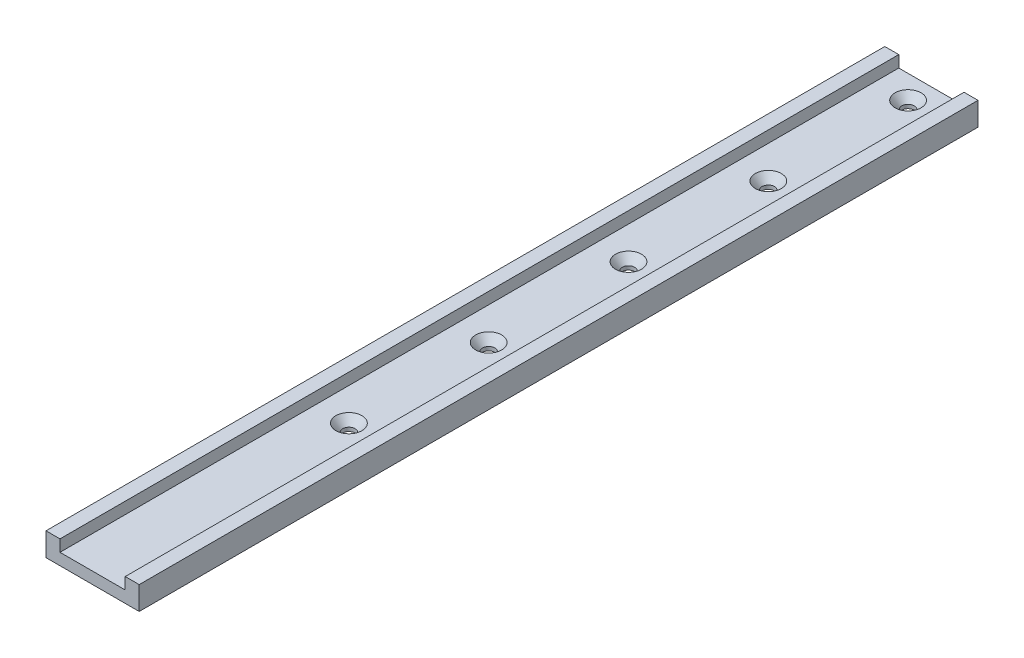
ISO-10303-21;
HEADER;
FILE_DESCRIPTION(('STEP AP214'),'2;1');
FILE_NAME('part.step','',(''),(''),'','','');
FILE_SCHEMA(('AUTOMOTIVE_DESIGN { 1 0 10303 214 1 1 1 1 }'));
ENDSEC;
DATA;
#1=APPLICATION_CONTEXT('core data for automotive mechanical design processes');
#2=APPLICATION_PROTOCOL_DEFINITION('international standard','automotive_design',2000,#1);
#3=PRODUCT_CONTEXT('',#1,'mechanical');
#4=PRODUCT('Part','Part','',(#3));
#5=PRODUCT_RELATED_PRODUCT_CATEGORY('part','',(#4));
#6=PRODUCT_DEFINITION_FORMATION('','',#4);
#7=PRODUCT_DEFINITION_CONTEXT('part definition',#1,'design');
#8=PRODUCT_DEFINITION('design','',#6,#7);
#9=PRODUCT_DEFINITION_SHAPE('','',#8);
#10=(LENGTH_UNIT() NAMED_UNIT(*) SI_UNIT(.MILLI.,.METRE.));
#11=(NAMED_UNIT(*) PLANE_ANGLE_UNIT() SI_UNIT($,.RADIAN.));
#12=(NAMED_UNIT(*) SI_UNIT($,.STERADIAN.) SOLID_ANGLE_UNIT());
#13=UNCERTAINTY_MEASURE_WITH_UNIT(LENGTH_MEASURE(1.E-05),#10,'distance_accuracy_value','');
#14=(GEOMETRIC_REPRESENTATION_CONTEXT(3) GLOBAL_UNCERTAINTY_ASSIGNED_CONTEXT((#13)) GLOBAL_UNIT_ASSIGNED_CONTEXT((#10,
#11,#12)) REPRESENTATION_CONTEXT('',''));
#15=CARTESIAN_POINT('',(0.,0.,0.));
#16=DIRECTION('',(0.,0.,1.));
#17=DIRECTION('',(1.,0.,0.));
#18=AXIS2_PLACEMENT_3D('',#15,#16,#17);
#19=CARTESIAN_POINT('',(-25.4,12.7,457.2));
#20=DIRECTION('',(1.,0.,0.));
#21=DIRECTION('',(0.,1.,0.));
#22=AXIS2_PLACEMENT_3D('',#19,#20,#21);
#23=PLANE('',#22);
#24=DIRECTION('',(0.,-1.,0.));
#25=VECTOR('',#24,1.);
#26=CARTESIAN_POINT('',(-25.4,12.7,0.));
#27=LINE('',#26,#25);
#28=CARTESIAN_POINT('',(-25.4,12.7,0.));
#29=VERTEX_POINT('',#28);
#30=CARTESIAN_POINT('',(-25.4,0.,0.));
#31=VERTEX_POINT('',#30);
#32=EDGE_CURVE('E133',#29,#31,#27,.T.);
#33=ORIENTED_EDGE('',*,*,#32,.T.);
#34=DIRECTION('',(0.,0.,-1.));
#35=VECTOR('',#34,1.);
#36=CARTESIAN_POINT('',(-25.4,0.,457.2));
#37=LINE('',#36,#35);
#38=CARTESIAN_POINT('',(-25.4,0.,457.2));
#39=VERTEX_POINT('',#38);
#40=EDGE_CURVE('E11',#39,#31,#37,.T.);
#41=ORIENTED_EDGE('',*,*,#40,.F.);
#42=DIRECTION('',(0.,-1.,0.));
#43=VECTOR('',#42,1.);
#44=CARTESIAN_POINT('',(-25.4,12.7,457.2));
#45=LINE('',#44,#43);
#46=CARTESIAN_POINT('',(-25.4,12.7,457.2));
#47=VERTEX_POINT('',#46);
#48=EDGE_CURVE('E148',#47,#39,#45,.T.);
#49=ORIENTED_EDGE('',*,*,#48,.F.);
#50=DIRECTION('',(0.,0.,-1.));
#51=VECTOR('',#50,1.);
#52=CARTESIAN_POINT('',(-25.4,12.7,457.2));
#53=LINE('',#52,#51);
#54=EDGE_CURVE('E129',#47,#29,#53,.T.);
#55=ORIENTED_EDGE('',*,*,#54,.T.);
#56=EDGE_LOOP('',(#33,#41,#49,#55));
#57=FACE_BOUND('',#56,.T.);
#58=ADVANCED_FACE('F37',(#57),#23,.F.);
#59=CARTESIAN_POINT('',(-25.4,0.,457.2));
#60=DIRECTION('',(0.,1.,0.));
#61=DIRECTION('',(-1.,0.,0.));
#62=AXIS2_PLACEMENT_3D('',#59,#60,#61);
#63=PLANE('',#62);
#64=CARTESIAN_POINT('',(0.,0.,12.7));
#65=DIRECTION('',(0.,1.,0.));
#66=DIRECTION('',(0.,0.,1.));
#67=AXIS2_PLACEMENT_3D('',#64,#65,#66);
#68=CIRCLE('',#67,3.3782);
#69=CARTESIAN_POINT('',(0.,0.,16.0782));
#70=VERTEX_POINT('',#69);
#71=EDGE_CURVE('E216',#70,#70,#68,.T.);
#72=ORIENTED_EDGE('',*,*,#71,.T.);
#73=EDGE_LOOP('',(#72));
#74=FACE_BOUND('',#73,.T.);
#75=CARTESIAN_POINT('',(0.,0.,88.9));
#76=DIRECTION('',(0.,1.,0.));
#77=DIRECTION('',(0.,0.,1.));
#78=AXIS2_PLACEMENT_3D('',#75,#76,#77);
#79=CIRCLE('',#78,3.3782);
#80=CARTESIAN_POINT('',(0.,0.,92.2782));
#81=VERTEX_POINT('',#80);
#82=EDGE_CURVE('E207',#81,#81,#79,.T.);
#83=ORIENTED_EDGE('',*,*,#82,.T.);
#84=EDGE_LOOP('',(#83));
#85=FACE_BOUND('',#84,.T.);
#86=CARTESIAN_POINT('',(0.,0.,165.1));
#87=DIRECTION('',(0.,1.,0.));
#88=DIRECTION('',(0.,0.,1.));
#89=AXIS2_PLACEMENT_3D('',#86,#87,#88);
#90=CIRCLE('',#89,3.3782);
#91=CARTESIAN_POINT('',(0.,0.,168.4782));
#92=VERTEX_POINT('',#91);
#93=EDGE_CURVE('E198',#92,#92,#90,.T.);
#94=ORIENTED_EDGE('',*,*,#93,.T.);
#95=EDGE_LOOP('',(#94));
#96=FACE_BOUND('',#95,.T.);
#97=CARTESIAN_POINT('',(0.,0.,241.3));
#98=DIRECTION('',(0.,1.,0.));
#99=DIRECTION('',(0.,0.,1.));
#100=AXIS2_PLACEMENT_3D('',#97,#98,#99);
#101=CIRCLE('',#100,3.3782);
#102=CARTESIAN_POINT('',(0.,0.,244.6782));
#103=VERTEX_POINT('',#102);
#104=EDGE_CURVE('E189',#103,#103,#101,.T.);
#105=ORIENTED_EDGE('',*,*,#104,.T.);
#106=EDGE_LOOP('',(#105));
#107=FACE_BOUND('',#106,.T.);
#108=CARTESIAN_POINT('',(0.,0.,317.5));
#109=DIRECTION('',(0.,1.,0.));
#110=DIRECTION('',(0.,0.,1.));
#111=AXIS2_PLACEMENT_3D('',#108,#109,#110);
#112=CIRCLE('',#111,3.3782);
#113=CARTESIAN_POINT('',(0.,0.,320.8782));
#114=VERTEX_POINT('',#113);
#115=EDGE_CURVE('E137',#114,#114,#112,.T.);
#116=ORIENTED_EDGE('',*,*,#115,.T.);
#117=EDGE_LOOP('',(#116));
#118=FACE_BOUND('',#117,.T.);
#119=DIRECTION('',(1.,0.,0.));
#120=VECTOR('',#119,1.);
#121=CARTESIAN_POINT('',(-25.4,0.,0.));
#122=LINE('',#121,#120);
#123=CARTESIAN_POINT('',(25.4,0.,0.));
#124=VERTEX_POINT('',#123);
#125=EDGE_CURVE('E136',#31,#124,#122,.T.);
#126=ORIENTED_EDGE('',*,*,#125,.T.);
#127=DIRECTION('',(0.,0.,-1.));
#128=VECTOR('',#127,1.);
#129=CARTESIAN_POINT('',(25.4,0.,457.2));
#130=LINE('',#129,#128);
#131=CARTESIAN_POINT('',(25.4,0.,457.2));
#132=VERTEX_POINT('',#131);
#133=EDGE_CURVE('E45',#132,#124,#130,.T.);
#134=ORIENTED_EDGE('',*,*,#133,.F.);
#135=DIRECTION('',(1.,0.,0.));
#136=VECTOR('',#135,1.);
#137=CARTESIAN_POINT('',(-25.4,0.,457.2));
#138=LINE('',#137,#136);
#139=EDGE_CURVE('E96',#39,#132,#138,.T.);
#140=ORIENTED_EDGE('',*,*,#139,.F.);
#141=ORIENTED_EDGE('',*,*,#40,.T.);
#142=EDGE_LOOP('',(#126,#134,#140,#141));
#143=FACE_BOUND('',#142,.T.);
#144=ADVANCED_FACE('F256',(#74,#85,#96,#107,#118,#143),#63,.F.);
#145=CARTESIAN_POINT('',(25.4,12.7,457.2));
#146=DIRECTION('',(-1.,0.,0.));
#147=DIRECTION('',(0.,0.,1.));
#148=AXIS2_PLACEMENT_3D('',#145,#146,#147);
#149=PLANE('',#148);
#150=DIRECTION('',(0.,1.,0.));
#151=VECTOR('',#150,1.);
#152=CARTESIAN_POINT('',(25.4,12.7,0.));
#153=LINE('',#152,#151);
#154=CARTESIAN_POINT('',(25.4,12.7,0.));
#155=VERTEX_POINT('',#154);
#156=EDGE_CURVE('E139',#124,#155,#153,.T.);
#157=ORIENTED_EDGE('',*,*,#156,.T.);
#158=DIRECTION('',(0.,0.,-1.));
#159=VECTOR('',#158,1.);
#160=CARTESIAN_POINT('',(25.4,12.7,457.2));
#161=LINE('',#160,#159);
#162=CARTESIAN_POINT('',(25.4,12.7,457.2));
#163=VERTEX_POINT('',#162);
#164=EDGE_CURVE('E155',#163,#155,#161,.T.);
#165=ORIENTED_EDGE('',*,*,#164,.F.);
#166=DIRECTION('',(0.,1.,0.));
#167=VECTOR('',#166,1.);
#168=CARTESIAN_POINT('',(25.4,12.7,457.2));
#169=LINE('',#168,#167);
#170=EDGE_CURVE('E163',#132,#163,#169,.T.);
#171=ORIENTED_EDGE('',*,*,#170,.F.);
#172=ORIENTED_EDGE('',*,*,#133,.T.);
#173=EDGE_LOOP('',(#157,#165,#171,#172));
#174=FACE_BOUND('',#173,.T.);
#175=ADVANCED_FACE('F161',(#174),#149,.F.);
#176=CARTESIAN_POINT('',(17.78,12.7,457.2));
#177=DIRECTION('',(0.,-1.,0.));
#178=DIRECTION('',(1.,0.,0.));
#179=AXIS2_PLACEMENT_3D('',#176,#177,#178);
#180=PLANE('',#179);
#181=DIRECTION('',(-1.,0.,0.));
#182=VECTOR('',#181,1.);
#183=CARTESIAN_POINT('',(17.78,12.7,0.));
#184=LINE('',#183,#182);
#185=CARTESIAN_POINT('',(17.78,12.7,0.));
#186=VERTEX_POINT('',#185);
#187=EDGE_CURVE('E141',#155,#186,#184,.T.);
#188=ORIENTED_EDGE('',*,*,#187,.T.);
#189=DIRECTION('',(0.,0.,-1.));
#190=VECTOR('',#189,1.);
#191=CARTESIAN_POINT('',(17.78,12.7,457.2));
#192=LINE('',#191,#190);
#193=CARTESIAN_POINT('',(17.78,12.7,457.2));
#194=VERTEX_POINT('',#193);
#195=EDGE_CURVE('E152',#194,#186,#192,.T.);
#196=ORIENTED_EDGE('',*,*,#195,.F.);
#197=DIRECTION('',(-1.,0.,0.));
#198=VECTOR('',#197,1.);
#199=CARTESIAN_POINT('',(17.78,12.7,457.2));
#200=LINE('',#199,#198);
#201=EDGE_CURVE('E175',#163,#194,#200,.T.);
#202=ORIENTED_EDGE('',*,*,#201,.F.);
#203=ORIENTED_EDGE('',*,*,#164,.T.);
#204=EDGE_LOOP('',(#188,#196,#202,#203));
#205=FACE_BOUND('',#204,.T.);
#206=ADVANCED_FACE('F171',(#205),#180,.F.);
#207=CARTESIAN_POINT('',(17.78,12.7,457.2));
#208=DIRECTION('',(1.,0.,0.));
#209=DIRECTION('',(0.,0.,-1.));
#210=AXIS2_PLACEMENT_3D('',#207,#208,#209);
#211=PLANE('',#210);
#212=DIRECTION('',(0.,-1.,0.));
#213=VECTOR('',#212,1.);
#214=CARTESIAN_POINT('',(17.78,12.7,0.));
#215=LINE('',#214,#213);
#216=CARTESIAN_POINT('',(17.78,6.35,0.));
#217=VERTEX_POINT('',#216);
#218=EDGE_CURVE('E143',#186,#217,#215,.T.);
#219=ORIENTED_EDGE('',*,*,#218,.T.);
#220=DIRECTION('',(0.,0.,-1.));
#221=VECTOR('',#220,1.);
#222=CARTESIAN_POINT('',(17.78,6.35,457.2));
#223=LINE('',#222,#221);
#224=CARTESIAN_POINT('',(17.78,6.35,457.2));
#225=VERTEX_POINT('',#224);
#226=EDGE_CURVE('E124',#225,#217,#223,.T.);
#227=ORIENTED_EDGE('',*,*,#226,.F.);
#228=DIRECTION('',(0.,-1.,0.));
#229=VECTOR('',#228,1.);
#230=CARTESIAN_POINT('',(17.78,12.7,457.2));
#231=LINE('',#230,#229);
#232=EDGE_CURVE('E115',#194,#225,#231,.T.);
#233=ORIENTED_EDGE('',*,*,#232,.F.);
#234=ORIENTED_EDGE('',*,*,#195,.T.);
#235=EDGE_LOOP('',(#219,#227,#233,#234));
#236=FACE_BOUND('',#235,.T.);
#237=ADVANCED_FACE('F174',(#236),#211,.F.);
#238=CARTESIAN_POINT('',(-17.78,6.35,457.2));
#239=DIRECTION('',(0.,-1.,0.));
#240=DIRECTION('',(0.,0.,-1.));
#241=AXIS2_PLACEMENT_3D('',#238,#239,#240);
#242=PLANE('',#241);
#243=CARTESIAN_POINT('',(0.,6.35,12.7));
#244=DIRECTION('',(0.,1.,0.));
#245=DIRECTION('',(0.,0.,1.));
#246=AXIS2_PLACEMENT_3D('',#243,#244,#245);
#247=CIRCLE('',#246,7.1012812);
#248=CARTESIAN_POINT('',(0.,6.35,19.8012812));
#249=VERTEX_POINT('',#248);
#250=EDGE_CURVE('E222',#249,#249,#247,.T.);
#251=ORIENTED_EDGE('',*,*,#250,.F.);
#252=EDGE_LOOP('',(#251));
#253=FACE_BOUND('',#252,.T.);
#254=CARTESIAN_POINT('',(0.,6.35,88.9));
#255=DIRECTION('',(0.,1.,0.));
#256=DIRECTION('',(0.,0.,1.));
#257=AXIS2_PLACEMENT_3D('',#254,#255,#256);
#258=CIRCLE('',#257,7.1012812);
#259=CARTESIAN_POINT('',(0.,6.35,96.0012812));
#260=VERTEX_POINT('',#259);
#261=EDGE_CURVE('E213',#260,#260,#258,.T.);
#262=ORIENTED_EDGE('',*,*,#261,.F.);
#263=EDGE_LOOP('',(#262));
#264=FACE_BOUND('',#263,.T.);
#265=CARTESIAN_POINT('',(0.,6.35,165.1));
#266=DIRECTION('',(0.,1.,0.));
#267=DIRECTION('',(0.,0.,1.));
#268=AXIS2_PLACEMENT_3D('',#265,#266,#267);
#269=CIRCLE('',#268,7.1012812);
#270=CARTESIAN_POINT('',(0.,6.35,172.2012812));
#271=VERTEX_POINT('',#270);
#272=EDGE_CURVE('E204',#271,#271,#269,.T.);
#273=ORIENTED_EDGE('',*,*,#272,.F.);
#274=EDGE_LOOP('',(#273));
#275=FACE_BOUND('',#274,.T.);
#276=CARTESIAN_POINT('',(0.,6.35,241.3));
#277=DIRECTION('',(0.,1.,0.));
#278=DIRECTION('',(0.,0.,1.));
#279=AXIS2_PLACEMENT_3D('',#276,#277,#278);
#280=CIRCLE('',#279,7.1012812);
#281=CARTESIAN_POINT('',(0.,6.35,248.4012812));
#282=VERTEX_POINT('',#281);
#283=EDGE_CURVE('E195',#282,#282,#280,.T.);
#284=ORIENTED_EDGE('',*,*,#283,.F.);
#285=EDGE_LOOP('',(#284));
#286=FACE_BOUND('',#285,.T.);
#287=CARTESIAN_POINT('',(0.,6.35,317.5));
#288=DIRECTION('',(0.,1.,0.));
#289=DIRECTION('',(0.,0.,1.));
#290=AXIS2_PLACEMENT_3D('',#287,#288,#289);
#291=CIRCLE('',#290,7.1012812);
#292=CARTESIAN_POINT('',(0.,6.35,324.6012812));
#293=VERTEX_POINT('',#292);
#294=EDGE_CURVE('E186',#293,#293,#291,.T.);
#295=ORIENTED_EDGE('',*,*,#294,.F.);
#296=EDGE_LOOP('',(#295));
#297=FACE_BOUND('',#296,.T.);
#298=DIRECTION('',(-1.,0.,0.));
#299=VECTOR('',#298,1.);
#300=CARTESIAN_POINT('',(-17.78,6.35,0.));
#301=LINE('',#300,#299);
#302=CARTESIAN_POINT('',(-17.78,6.35,0.));
#303=VERTEX_POINT('',#302);
#304=EDGE_CURVE('E123',#217,#303,#301,.T.);
#305=ORIENTED_EDGE('',*,*,#304,.T.);
#306=DIRECTION('',(0.,0.,-1.));
#307=VECTOR('',#306,1.);
#308=CARTESIAN_POINT('',(-17.78,6.35,457.2));
#309=LINE('',#308,#307);
#310=CARTESIAN_POINT('',(-17.78,6.35,457.2));
#311=VERTEX_POINT('',#310);
#312=EDGE_CURVE('E120',#311,#303,#309,.T.);
#313=ORIENTED_EDGE('',*,*,#312,.F.);
#314=DIRECTION('',(-1.,0.,0.));
#315=VECTOR('',#314,1.);
#316=CARTESIAN_POINT('',(-17.78,6.35,457.2));
#317=LINE('',#316,#315);
#318=EDGE_CURVE('E109',#225,#311,#317,.T.);
#319=ORIENTED_EDGE('',*,*,#318,.F.);
#320=ORIENTED_EDGE('',*,*,#226,.T.);
#321=EDGE_LOOP('',(#305,#313,#319,#320));
#322=FACE_BOUND('',#321,.T.);
#323=ADVANCED_FACE('F121',(#253,#264,#275,#286,#297,#322),#242,.F.);
#324=CARTESIAN_POINT('',(-17.78,6.35,457.2));
#325=DIRECTION('',(-1.,0.,0.));
#326=DIRECTION('',(0.,0.,1.));
#327=AXIS2_PLACEMENT_3D('',#324,#325,#326);
#328=PLANE('',#327);
#329=DIRECTION('',(0.,1.,0.));
#330=VECTOR('',#329,1.);
#331=CARTESIAN_POINT('',(-17.78,6.35,0.));
#332=LINE('',#331,#330);
#333=CARTESIAN_POINT('',(-17.78,12.7,0.));
#334=VERTEX_POINT('',#333);
#335=EDGE_CURVE('E82',#303,#334,#332,.T.);
#336=ORIENTED_EDGE('',*,*,#335,.T.);
#337=DIRECTION('',(0.,0.,-1.));
#338=VECTOR('',#337,1.);
#339=CARTESIAN_POINT('',(-17.78,12.7,457.2));
#340=LINE('',#339,#338);
#341=CARTESIAN_POINT('',(-17.78,12.7,457.2));
#342=VERTEX_POINT('',#341);
#343=EDGE_CURVE('E125',#342,#334,#340,.T.);
#344=ORIENTED_EDGE('',*,*,#343,.F.);
#345=DIRECTION('',(0.,1.,0.));
#346=VECTOR('',#345,1.);
#347=CARTESIAN_POINT('',(-17.78,6.35,457.2));
#348=LINE('',#347,#346);
#349=EDGE_CURVE('E113',#311,#342,#348,.T.);
#350=ORIENTED_EDGE('',*,*,#349,.F.);
#351=ORIENTED_EDGE('',*,*,#312,.T.);
#352=EDGE_LOOP('',(#336,#344,#350,#351));
#353=FACE_BOUND('',#352,.T.);
#354=ADVANCED_FACE('F127',(#353),#328,.F.);
#355=CARTESIAN_POINT('',(-25.4,12.7,457.2));
#356=DIRECTION('',(0.,-1.,0.));
#357=DIRECTION('',(1.,0.,0.));
#358=AXIS2_PLACEMENT_3D('',#355,#356,#357);
#359=PLANE('',#358);
#360=DIRECTION('',(-1.,0.,0.));
#361=VECTOR('',#360,1.);
#362=CARTESIAN_POINT('',(-25.4,12.7,0.));
#363=LINE('',#362,#361);
#364=EDGE_CURVE('E88',#334,#29,#363,.T.);
#365=ORIENTED_EDGE('',*,*,#364,.T.);
#366=ORIENTED_EDGE('',*,*,#54,.F.);
#367=DIRECTION('',(-1.,0.,0.));
#368=VECTOR('',#367,1.);
#369=CARTESIAN_POINT('',(-25.4,12.7,457.2));
#370=LINE('',#369,#368);
#371=EDGE_CURVE('E53',#342,#47,#370,.T.);
#372=ORIENTED_EDGE('',*,*,#371,.F.);
#373=ORIENTED_EDGE('',*,*,#343,.T.);
#374=EDGE_LOOP('',(#365,#366,#372,#373));
#375=FACE_BOUND('',#374,.T.);
#376=ADVANCED_FACE('F264',(#375),#359,.F.);
#377=CARTESIAN_POINT('',(0.,0.,457.2));
#378=DIRECTION('',(0.,0.,1.));
#379=DIRECTION('',(1.,0.,0.));
#380=AXIS2_PLACEMENT_3D('',#377,#378,#379);
#381=PLANE('',#380);
#382=ORIENTED_EDGE('',*,*,#48,.T.);
#383=ORIENTED_EDGE('',*,*,#139,.T.);
#384=ORIENTED_EDGE('',*,*,#170,.T.);
#385=ORIENTED_EDGE('',*,*,#201,.T.);
#386=ORIENTED_EDGE('',*,*,#232,.T.);
#387=ORIENTED_EDGE('',*,*,#318,.T.);
#388=ORIENTED_EDGE('',*,*,#349,.T.);
#389=ORIENTED_EDGE('',*,*,#371,.T.);
#390=EDGE_LOOP('',(#382,#383,#384,#385,#386,#387,#388,#389));
#391=FACE_BOUND('',#390,.T.);
#392=ADVANCED_FACE('F111',(#391),#381,.T.);
#393=CARTESIAN_POINT('',(0.,0.,0.));
#394=DIRECTION('',(0.,0.,1.));
#395=DIRECTION('',(1.,0.,0.));
#396=AXIS2_PLACEMENT_3D('',#393,#394,#395);
#397=PLANE('',#396);
#398=ORIENTED_EDGE('',*,*,#32,.F.);
#399=ORIENTED_EDGE('',*,*,#364,.F.);
#400=ORIENTED_EDGE('',*,*,#335,.F.);
#401=ORIENTED_EDGE('',*,*,#304,.F.);
#402=ORIENTED_EDGE('',*,*,#218,.F.);
#403=ORIENTED_EDGE('',*,*,#187,.F.);
#404=ORIENTED_EDGE('',*,*,#156,.F.);
#405=ORIENTED_EDGE('',*,*,#125,.F.);
#406=EDGE_LOOP('',(#398,#399,#400,#401,#402,#403,#404,#405));
#407=FACE_BOUND('',#406,.T.);
#408=ADVANCED_FACE('F167',(#407),#397,.F.);
#409=CARTESIAN_POINT('',(0.,6.35,317.5));
#410=DIRECTION('',(0.,1.,0.));
#411=DIRECTION('',(0.,0.,1.));
#412=AXIS2_PLACEMENT_3D('',#409,#410,#411);
#413=CYLINDRICAL_SURFACE('',#412,3.3782);
#414=ORIENTED_EDGE('',*,*,#115,.F.);
#415=EDGE_LOOP('',(#414));
#416=FACE_BOUND('',#415,.T.);
#417=CARTESIAN_POINT('',(0.,2.06708501000152,317.5));
#418=DIRECTION('',(0.,1.,0.));
#419=DIRECTION('',(0.,0.,1.));
#420=AXIS2_PLACEMENT_3D('',#417,#418,#419);
#421=CIRCLE('',#420,3.3782);
#422=CARTESIAN_POINT('',(0.,2.06708501000152,320.8782));
#423=VERTEX_POINT('',#422);
#424=EDGE_CURVE('E183',#423,#423,#421,.T.);
#425=ORIENTED_EDGE('',*,*,#424,.T.);
#426=EDGE_LOOP('',(#425));
#427=FACE_BOUND('',#426,.T.);
#428=ADVANCED_FACE('F242',(#416,#427),#413,.F.);
#429=CARTESIAN_POINT('',(0.,6.35,317.5));
#430=DIRECTION('',(0.,1.,0.));
#431=DIRECTION('',(0.,0.,1.));
#432=AXIS2_PLACEMENT_3D('',#429,#430,#431);
#433=CONICAL_SURFACE('',#432,7.1012812,0.715584993317676);
#434=ORIENTED_EDGE('',*,*,#424,.F.);
#435=EDGE_LOOP('',(#434));
#436=FACE_BOUND('',#435,.T.);
#437=ORIENTED_EDGE('',*,*,#294,.T.);
#438=EDGE_LOOP('',(#437));
#439=FACE_BOUND('',#438,.T.);
#440=ADVANCED_FACE('F239',(#436,#439),#433,.F.);
#441=CARTESIAN_POINT('',(0.,6.35,241.3));
#442=DIRECTION('',(0.,1.,0.));
#443=DIRECTION('',(0.,0.,1.));
#444=AXIS2_PLACEMENT_3D('',#441,#442,#443);
#445=CYLINDRICAL_SURFACE('',#444,3.3782);
#446=ORIENTED_EDGE('',*,*,#104,.F.);
#447=EDGE_LOOP('',(#446));
#448=FACE_BOUND('',#447,.T.);
#449=CARTESIAN_POINT('',(0.,2.06708501000152,241.3));
#450=DIRECTION('',(0.,1.,0.));
#451=DIRECTION('',(0.,0.,1.));
#452=AXIS2_PLACEMENT_3D('',#449,#450,#451);
#453=CIRCLE('',#452,3.3782);
#454=CARTESIAN_POINT('',(0.,2.06708501000152,244.6782));
#455=VERTEX_POINT('',#454);
#456=EDGE_CURVE('E192',#455,#455,#453,.T.);
#457=ORIENTED_EDGE('',*,*,#456,.T.);
#458=EDGE_LOOP('',(#457));
#459=FACE_BOUND('',#458,.T.);
#460=ADVANCED_FACE('F241',(#448,#459),#445,.F.);
#461=CARTESIAN_POINT('',(0.,6.35,241.3));
#462=DIRECTION('',(0.,1.,0.));
#463=DIRECTION('',(0.,0.,1.));
#464=AXIS2_PLACEMENT_3D('',#461,#462,#463);
#465=CONICAL_SURFACE('',#464,7.1012812,0.715584993317676);
#466=ORIENTED_EDGE('',*,*,#456,.F.);
#467=EDGE_LOOP('',(#466));
#468=FACE_BOUND('',#467,.T.);
#469=ORIENTED_EDGE('',*,*,#283,.T.);
#470=EDGE_LOOP('',(#469));
#471=FACE_BOUND('',#470,.T.);
#472=ADVANCED_FACE('F249',(#468,#471),#465,.F.);
#473=CARTESIAN_POINT('',(0.,6.35,165.1));
#474=DIRECTION('',(0.,1.,0.));
#475=DIRECTION('',(0.,0.,1.));
#476=AXIS2_PLACEMENT_3D('',#473,#474,#475);
#477=CYLINDRICAL_SURFACE('',#476,3.3782);
#478=ORIENTED_EDGE('',*,*,#93,.F.);
#479=EDGE_LOOP('',(#478));
#480=FACE_BOUND('',#479,.T.);
#481=CARTESIAN_POINT('',(0.,2.06708501000152,165.1));
#482=DIRECTION('',(0.,1.,0.));
#483=DIRECTION('',(0.,0.,1.));
#484=AXIS2_PLACEMENT_3D('',#481,#482,#483);
#485=CIRCLE('',#484,3.3782);
#486=CARTESIAN_POINT('',(0.,2.06708501000152,168.4782));
#487=VERTEX_POINT('',#486);
#488=EDGE_CURVE('E201',#487,#487,#485,.T.);
#489=ORIENTED_EDGE('',*,*,#488,.T.);
#490=EDGE_LOOP('',(#489));
#491=FACE_BOUND('',#490,.T.);
#492=ADVANCED_FACE('F358',(#480,#491),#477,.F.);
#493=CARTESIAN_POINT('',(0.,6.35,165.1));
#494=DIRECTION('',(0.,1.,0.));
#495=DIRECTION('',(0.,0.,1.));
#496=AXIS2_PLACEMENT_3D('',#493,#494,#495);
#497=CONICAL_SURFACE('',#496,7.1012812,0.715584993317676);
#498=ORIENTED_EDGE('',*,*,#488,.F.);
#499=EDGE_LOOP('',(#498));
#500=FACE_BOUND('',#499,.T.);
#501=ORIENTED_EDGE('',*,*,#272,.T.);
#502=EDGE_LOOP('',(#501));
#503=FACE_BOUND('',#502,.T.);
#504=ADVANCED_FACE('F368',(#500,#503),#497,.F.);
#505=CARTESIAN_POINT('',(0.,6.35,88.9));
#506=DIRECTION('',(0.,1.,0.));
#507=DIRECTION('',(0.,0.,1.));
#508=AXIS2_PLACEMENT_3D('',#505,#506,#507);
#509=CYLINDRICAL_SURFACE('',#508,3.3782);
#510=ORIENTED_EDGE('',*,*,#82,.F.);
#511=EDGE_LOOP('',(#510));
#512=FACE_BOUND('',#511,.T.);
#513=CARTESIAN_POINT('',(0.,2.06708501000152,88.9));
#514=DIRECTION('',(0.,1.,0.));
#515=DIRECTION('',(0.,0.,1.));
#516=AXIS2_PLACEMENT_3D('',#513,#514,#515);
#517=CIRCLE('',#516,3.3782);
#518=CARTESIAN_POINT('',(0.,2.06708501000152,92.2782));
#519=VERTEX_POINT('',#518);
#520=EDGE_CURVE('E210',#519,#519,#517,.T.);
#521=ORIENTED_EDGE('',*,*,#520,.T.);
#522=EDGE_LOOP('',(#521));
#523=FACE_BOUND('',#522,.T.);
#524=ADVANCED_FACE('F378',(#512,#523),#509,.F.);
#525=CARTESIAN_POINT('',(0.,6.35,88.9));
#526=DIRECTION('',(0.,1.,0.));
#527=DIRECTION('',(0.,0.,1.));
#528=AXIS2_PLACEMENT_3D('',#525,#526,#527);
#529=CONICAL_SURFACE('',#528,7.1012812,0.715584993317676);
#530=ORIENTED_EDGE('',*,*,#520,.F.);
#531=EDGE_LOOP('',(#530));
#532=FACE_BOUND('',#531,.T.);
#533=ORIENTED_EDGE('',*,*,#261,.T.);
#534=EDGE_LOOP('',(#533));
#535=FACE_BOUND('',#534,.T.);
#536=ADVANCED_FACE('F388',(#532,#535),#529,.F.);
#537=CARTESIAN_POINT('',(0.,6.35,12.7));
#538=DIRECTION('',(0.,1.,0.));
#539=DIRECTION('',(0.,0.,1.));
#540=AXIS2_PLACEMENT_3D('',#537,#538,#539);
#541=CYLINDRICAL_SURFACE('',#540,3.3782);
#542=ORIENTED_EDGE('',*,*,#71,.F.);
#543=EDGE_LOOP('',(#542));
#544=FACE_BOUND('',#543,.T.);
#545=CARTESIAN_POINT('',(0.,2.06708501000152,12.7));
#546=DIRECTION('',(0.,1.,0.));
#547=DIRECTION('',(0.,0.,1.));
#548=AXIS2_PLACEMENT_3D('',#545,#546,#547);
#549=CIRCLE('',#548,3.3782);
#550=CARTESIAN_POINT('',(0.,2.06708501000152,16.0782));
#551=VERTEX_POINT('',#550);
#552=EDGE_CURVE('E219',#551,#551,#549,.T.);
#553=ORIENTED_EDGE('',*,*,#552,.T.);
#554=EDGE_LOOP('',(#553));
#555=FACE_BOUND('',#554,.T.);
#556=ADVANCED_FACE('F398',(#544,#555),#541,.F.);
#557=CARTESIAN_POINT('',(0.,6.35,12.7));
#558=DIRECTION('',(0.,1.,0.));
#559=DIRECTION('',(0.,0.,1.));
#560=AXIS2_PLACEMENT_3D('',#557,#558,#559);
#561=CONICAL_SURFACE('',#560,7.1012812,0.715584993317676);
#562=ORIENTED_EDGE('',*,*,#552,.F.);
#563=EDGE_LOOP('',(#562));
#564=FACE_BOUND('',#563,.T.);
#565=ORIENTED_EDGE('',*,*,#250,.T.);
#566=EDGE_LOOP('',(#565));
#567=FACE_BOUND('',#566,.T.);
#568=ADVANCED_FACE('F226',(#564,#567),#561,.F.);
#569=CLOSED_SHELL('',(#58,#144,#175,#206,#237,#323,#354,#376,#392,#408,#428,#440,#460,#472,#492,
#504,#524,#536,#556,#568));
#570=MANIFOLD_SOLID_BREP('B2',#569);
#571=ADVANCED_BREP_SHAPE_REPRESENTATION('',(#18,#570),#14);
#572=SHAPE_DEFINITION_REPRESENTATION(#9,#571);
ENDSEC;
END-ISO-10303-21;
